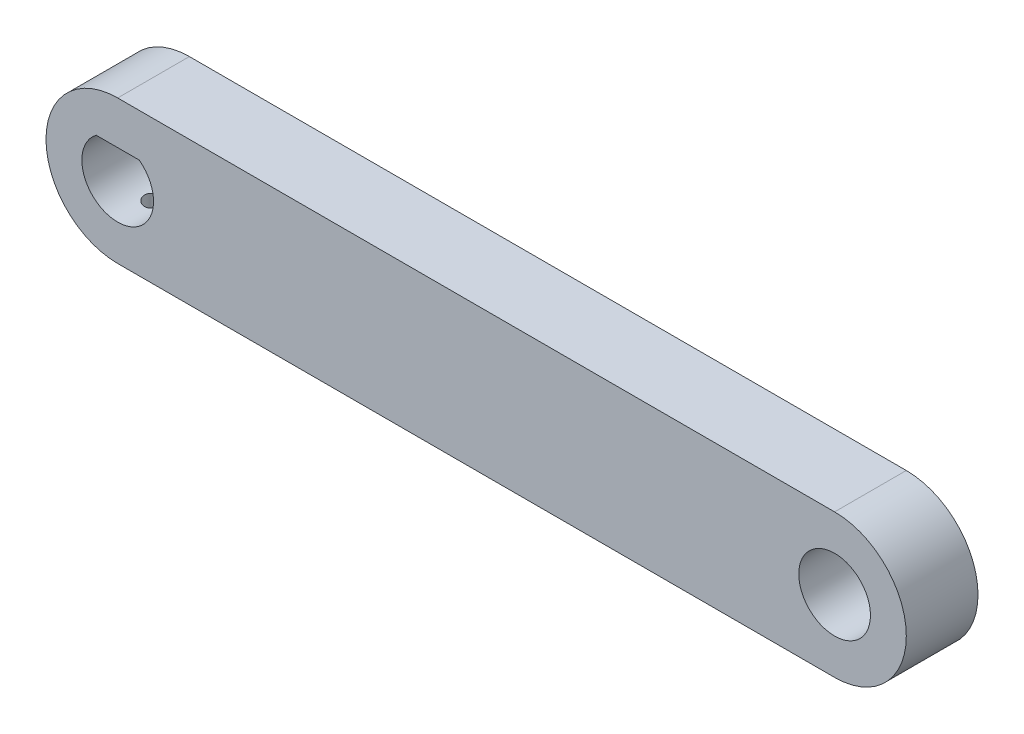
ISO-10303-21;
HEADER;
FILE_DESCRIPTION(('STEP AP214'),'2;1');
FILE_NAME('part.step','',(''),(''),'','','');
FILE_SCHEMA(('AUTOMOTIVE_DESIGN { 1 0 10303 214 1 1 1 1 }'));
ENDSEC;
DATA;
#1=APPLICATION_CONTEXT('core data for automotive mechanical design processes');
#2=APPLICATION_PROTOCOL_DEFINITION('international standard','automotive_design',2000,#1);
#3=PRODUCT_CONTEXT('',#1,'mechanical');
#4=PRODUCT('Part','Part','',(#3));
#5=PRODUCT_RELATED_PRODUCT_CATEGORY('part','',(#4));
#6=PRODUCT_DEFINITION_FORMATION('','',#4);
#7=PRODUCT_DEFINITION_CONTEXT('part definition',#1,'design');
#8=PRODUCT_DEFINITION('design','',#6,#7);
#9=PRODUCT_DEFINITION_SHAPE('','',#8);
#10=(LENGTH_UNIT() NAMED_UNIT(*) SI_UNIT(.MILLI.,.METRE.));
#11=(NAMED_UNIT(*) PLANE_ANGLE_UNIT() SI_UNIT($,.RADIAN.));
#12=(NAMED_UNIT(*) SI_UNIT($,.STERADIAN.) SOLID_ANGLE_UNIT());
#13=UNCERTAINTY_MEASURE_WITH_UNIT(LENGTH_MEASURE(1.E-05),#10,'distance_accuracy_value','');
#14=(GEOMETRIC_REPRESENTATION_CONTEXT(3) GLOBAL_UNCERTAINTY_ASSIGNED_CONTEXT((#13)) GLOBAL_UNIT_ASSIGNED_CONTEXT((#10,
#11,#12)) REPRESENTATION_CONTEXT('',''));
#15=CARTESIAN_POINT('',(0.,0.,0.));
#16=DIRECTION('',(0.,0.,1.));
#17=DIRECTION('',(1.,0.,0.));
#18=AXIS2_PLACEMENT_3D('',#15,#16,#17);
#19=CARTESIAN_POINT('',(50.,0.,10.));
#20=DIRECTION('',(0.,0.,-1.));
#21=DIRECTION('',(-1.,0.,0.));
#22=AXIS2_PLACEMENT_3D('',#19,#20,#21);
#23=PLANE('',#22);
#24=CARTESIAN_POINT('',(50.,0.,10.));
#25=DIRECTION('',(0.,0.,1.));
#26=DIRECTION('',(1.,0.,0.));
#27=AXIS2_PLACEMENT_3D('',#24,#25,#26);
#28=CIRCLE('',#27,5.);
#29=CARTESIAN_POINT('',(55.,0.,10.));
#30=VERTEX_POINT('',#29);
#31=EDGE_CURVE('E130',#30,#30,#28,.T.);
#32=ORIENTED_EDGE('',*,*,#31,.F.);
#33=EDGE_LOOP('',(#32));
#34=FACE_BOUND('',#33,.T.);
#35=CARTESIAN_POINT('',(50.,0.,10.));
#36=DIRECTION('',(0.,0.,1.));
#37=DIRECTION('',(-1.,0.,0.));
#38=AXIS2_PLACEMENT_3D('',#35,#36,#37);
#39=CIRCLE('',#38,10.);
#40=CARTESIAN_POINT('',(50.,-10.,10.));
#41=VERTEX_POINT('',#40);
#42=CARTESIAN_POINT('',(50.,10.,10.));
#43=VERTEX_POINT('',#42);
#44=EDGE_CURVE('E122',#41,#43,#39,.T.);
#45=ORIENTED_EDGE('',*,*,#44,.T.);
#46=DIRECTION('',(-1.,0.,0.));
#47=VECTOR('',#46,1.);
#48=CARTESIAN_POINT('',(-50.,10.,10.));
#49=LINE('',#48,#47);
#50=CARTESIAN_POINT('',(-50.,10.,10.));
#51=VERTEX_POINT('',#50);
#52=EDGE_CURVE('E134',#43,#51,#49,.T.);
#53=ORIENTED_EDGE('',*,*,#52,.T.);
#54=CARTESIAN_POINT('',(-50.,0.,10.));
#55=DIRECTION('',(0.,0.,1.));
#56=DIRECTION('',(1.,0.,0.));
#57=AXIS2_PLACEMENT_3D('',#54,#55,#56);
#58=CIRCLE('',#57,10.);
#59=CARTESIAN_POINT('',(-50.,-10.,10.));
#60=VERTEX_POINT('',#59);
#61=EDGE_CURVE('E132',#51,#60,#58,.T.);
#62=ORIENTED_EDGE('',*,*,#61,.T.);
#63=DIRECTION('',(1.,0.,0.));
#64=VECTOR('',#63,1.);
#65=CARTESIAN_POINT('',(-50.,-10.,10.));
#66=LINE('',#65,#64);
#67=EDGE_CURVE('E112',#60,#41,#66,.T.);
#68=ORIENTED_EDGE('',*,*,#67,.T.);
#69=EDGE_LOOP('',(#45,#53,#62,#68));
#70=FACE_BOUND('',#69,.T.);
#71=CARTESIAN_POINT('',(-50.,0.,10.));
#72=DIRECTION('',(0.,0.,1.));
#73=DIRECTION('',(1.,0.,0.));
#74=AXIS2_PLACEMENT_3D('',#71,#72,#73);
#75=CIRCLE('',#74,5.);
#76=CARTESIAN_POINT('',(-53.,4.,10.));
#77=VERTEX_POINT('',#76);
#78=CARTESIAN_POINT('',(-47.,4.,10.));
#79=VERTEX_POINT('',#78);
#80=EDGE_CURVE('E151',#77,#79,#75,.T.);
#81=ORIENTED_EDGE('',*,*,#80,.F.);
#82=DIRECTION('',(-1.,0.,0.));
#83=VECTOR('',#82,1.);
#84=CARTESIAN_POINT('',(-53.,4.,10.));
#85=LINE('',#84,#83);
#86=EDGE_CURVE('E147',#79,#77,#85,.T.);
#87=ORIENTED_EDGE('',*,*,#86,.F.);
#88=EDGE_LOOP('',(#81,#87));
#89=FACE_BOUND('',#88,.T.);
#90=ADVANCED_FACE('F33',(#34,#70,#89),#23,.F.);
#91=CARTESIAN_POINT('',(50.,0.,0.));
#92=DIRECTION('',(0.,0.,-1.));
#93=DIRECTION('',(-1.,0.,0.));
#94=AXIS2_PLACEMENT_3D('',#91,#92,#93);
#95=PLANE('',#94);
#96=CARTESIAN_POINT('',(50.,0.,0.));
#97=DIRECTION('',(0.,0.,1.));
#98=DIRECTION('',(-1.,0.,0.));
#99=AXIS2_PLACEMENT_3D('',#96,#97,#98);
#100=CIRCLE('',#99,10.);
#101=CARTESIAN_POINT('',(50.,-10.,0.));
#102=VERTEX_POINT('',#101);
#103=CARTESIAN_POINT('',(50.,10.,0.));
#104=VERTEX_POINT('',#103);
#105=EDGE_CURVE('E127',#102,#104,#100,.T.);
#106=ORIENTED_EDGE('',*,*,#105,.F.);
#107=DIRECTION('',(1.,0.,0.));
#108=VECTOR('',#107,1.);
#109=CARTESIAN_POINT('',(-50.,-10.,0.));
#110=LINE('',#109,#108);
#111=CARTESIAN_POINT('',(-50.,-10.,0.));
#112=VERTEX_POINT('',#111);
#113=EDGE_CURVE('E120',#112,#102,#110,.T.);
#114=ORIENTED_EDGE('',*,*,#113,.F.);
#115=CARTESIAN_POINT('',(-50.,0.,0.));
#116=DIRECTION('',(0.,0.,1.));
#117=DIRECTION('',(1.,0.,0.));
#118=AXIS2_PLACEMENT_3D('',#115,#116,#117);
#119=CIRCLE('',#118,10.);
#120=CARTESIAN_POINT('',(-50.,10.,0.));
#121=VERTEX_POINT('',#120);
#122=EDGE_CURVE('E123',#121,#112,#119,.T.);
#123=ORIENTED_EDGE('',*,*,#122,.F.);
#124=DIRECTION('',(-1.,0.,0.));
#125=VECTOR('',#124,1.);
#126=CARTESIAN_POINT('',(-50.,10.,0.));
#127=LINE('',#126,#125);
#128=EDGE_CURVE('E125',#104,#121,#127,.T.);
#129=ORIENTED_EDGE('',*,*,#128,.F.);
#130=EDGE_LOOP('',(#106,#114,#123,#129));
#131=FACE_BOUND('',#130,.T.);
#132=CARTESIAN_POINT('',(50.,0.,0.));
#133=DIRECTION('',(0.,0.,1.));
#134=DIRECTION('',(1.,0.,0.));
#135=AXIS2_PLACEMENT_3D('',#132,#133,#134);
#136=CIRCLE('',#135,5.);
#137=CARTESIAN_POINT('',(55.,0.,0.));
#138=VERTEX_POINT('',#137);
#139=EDGE_CURVE('E138',#138,#138,#136,.T.);
#140=ORIENTED_EDGE('',*,*,#139,.T.);
#141=EDGE_LOOP('',(#140));
#142=FACE_BOUND('',#141,.T.);
#143=DIRECTION('',(-1.,0.,0.));
#144=VECTOR('',#143,1.);
#145=CARTESIAN_POINT('',(-53.,4.,0.));
#146=LINE('',#145,#144);
#147=CARTESIAN_POINT('',(-47.,4.,0.));
#148=VERTEX_POINT('',#147);
#149=CARTESIAN_POINT('',(-53.,4.,0.));
#150=VERTEX_POINT('',#149);
#151=EDGE_CURVE('E148',#148,#150,#146,.T.);
#152=ORIENTED_EDGE('',*,*,#151,.T.);
#153=CARTESIAN_POINT('',(-50.,0.,0.));
#154=DIRECTION('',(0.,0.,1.));
#155=DIRECTION('',(1.,0.,0.));
#156=AXIS2_PLACEMENT_3D('',#153,#154,#155);
#157=CIRCLE('',#156,5.);
#158=EDGE_CURVE('E108',#150,#148,#157,.T.);
#159=ORIENTED_EDGE('',*,*,#158,.T.);
#160=EDGE_LOOP('',(#152,#159));
#161=FACE_BOUND('',#160,.T.);
#162=ADVANCED_FACE('F179',(#131,#142,#161),#95,.T.);
#163=CARTESIAN_POINT('',(50.,0.,10.));
#164=DIRECTION('',(0.,0.,-1.));
#165=DIRECTION('',(-1.,0.,0.));
#166=AXIS2_PLACEMENT_3D('',#163,#164,#165);
#167=CYLINDRICAL_SURFACE('',#166,10.);
#168=ORIENTED_EDGE('',*,*,#105,.T.);
#169=DIRECTION('',(0.,0.,-1.));
#170=VECTOR('',#169,1.);
#171=CARTESIAN_POINT('',(50.,10.,10.));
#172=LINE('',#171,#170);
#173=EDGE_CURVE('E11',#43,#104,#172,.T.);
#174=ORIENTED_EDGE('',*,*,#173,.F.);
#175=ORIENTED_EDGE('',*,*,#44,.F.);
#176=DIRECTION('',(0.,0.,-1.));
#177=VECTOR('',#176,1.);
#178=CARTESIAN_POINT('',(50.,-10.,10.));
#179=LINE('',#178,#177);
#180=EDGE_CURVE('E116',#41,#102,#179,.T.);
#181=ORIENTED_EDGE('',*,*,#180,.T.);
#182=EDGE_LOOP('',(#168,#174,#175,#181));
#183=FACE_BOUND('',#182,.T.);
#184=ADVANCED_FACE('F35',(#183),#167,.T.);
#185=CARTESIAN_POINT('',(-50.,10.,10.));
#186=DIRECTION('',(0.,-1.,0.));
#187=DIRECTION('',(0.,0.,-1.));
#188=AXIS2_PLACEMENT_3D('',#185,#186,#187);
#189=PLANE('',#188);
#190=ORIENTED_EDGE('',*,*,#128,.T.);
#191=DIRECTION('',(0.,0.,-1.));
#192=VECTOR('',#191,1.);
#193=CARTESIAN_POINT('',(-50.,10.,10.));
#194=LINE('',#193,#192);
#195=EDGE_CURVE('E46',#51,#121,#194,.T.);
#196=ORIENTED_EDGE('',*,*,#195,.F.);
#197=ORIENTED_EDGE('',*,*,#52,.F.);
#198=ORIENTED_EDGE('',*,*,#173,.T.);
#199=EDGE_LOOP('',(#190,#196,#197,#198));
#200=FACE_BOUND('',#199,.T.);
#201=ADVANCED_FACE('F187',(#200),#189,.F.);
#202=CARTESIAN_POINT('',(-50.,0.,10.));
#203=DIRECTION('',(0.,0.,-1.));
#204=DIRECTION('',(-1.,0.,0.));
#205=AXIS2_PLACEMENT_3D('',#202,#203,#204);
#206=CYLINDRICAL_SURFACE('',#205,10.);
#207=DIRECTION('',(0.,0.,-1.));
#208=VECTOR('',#207,1.);
#209=CARTESIAN_POINT('',(-50.,-10.,10.));
#210=LINE('',#209,#208);
#211=CARTESIAN_POINT('',(-50.,-10.,3.75));
#212=VERTEX_POINT('',#211);
#213=EDGE_CURVE('E107',#212,#112,#210,.T.);
#214=ORIENTED_EDGE('',*,*,#213,.F.);
#215=CARTESIAN_POINT('',(-50.,-10.,3.75));
#216=CARTESIAN_POINT('',(-50.0350224303089,-10.0000010257072,3.75000007275596));
#217=CARTESIAN_POINT('',(-50.070027951116,-9.99981578224008,3.75147281210121));
#218=CARTESIAN_POINT('',(-50.1397858706033,-9.99908364149504,3.75734711411078));
#219=CARTESIAN_POINT('',(-50.1745382883709,-9.99853677178007,3.7617484535589));
#220=CARTESIAN_POINT('',(-50.2779631546587,-9.99637276286865,3.77929857508668));
#221=CARTESIAN_POINT('',(-50.3459386360616,-9.99423214223442,3.79679360712196));
#222=CARTESIAN_POINT('',(-50.4779570703992,-9.98879054889774,3.84286830901248));
#223=CARTESIAN_POINT('',(-50.5419987145779,-9.9854891924577,3.87145164496846));
#224=CARTESIAN_POINT('',(-50.6643811009187,-9.97809384677873,3.93887994605988));
#225=CARTESIAN_POINT('',(-50.722722300247,-9.97399992118116,3.97772408736892));
#226=CARTESIAN_POINT('',(-50.8323544687385,-9.96545183597717,4.06479376319411));
#227=CARTESIAN_POINT('',(-50.8836101263094,-9.96099603624693,4.11306358291034));
#228=CARTESIAN_POINT('',(-50.9773217643362,-9.95223907260072,4.21752559335189));
#229=CARTESIAN_POINT('',(-51.019776388504,-9.94793793260296,4.27371900290764));
#230=CARTESIAN_POINT('',(-51.0948062657025,-9.93996140974645,4.3926617665809));
#231=CARTESIAN_POINT('',(-51.1273480009107,-9.93628816793261,4.45543241933371));
#232=CARTESIAN_POINT('',(-51.1814128031938,-9.93000548633833,4.58559753444209));
#233=CARTESIAN_POINT('',(-51.2029369412445,-9.92739594316509,4.65299154665718));
#234=CARTESIAN_POINT('',(-51.2342493040182,-9.92355172150395,4.7901212644795));
#235=CARTESIAN_POINT('',(-51.24409812009,-9.92230994711778,4.85984293218617));
#236=CARTESIAN_POINT('',(-51.2519678206247,-9.92132013485285,4.99996142018386));
#237=CARTESIAN_POINT('',(-51.2499888940935,-9.92157207310476,5.07035822966826));
#238=CARTESIAN_POINT('',(-51.2343085986478,-9.92353477948583,5.20940260389039));
#239=CARTESIAN_POINT('',(-51.2206743119572,-9.92523719920774,5.27805786823219));
#240=CARTESIAN_POINT('',(-51.1821750510369,-9.92989601478217,5.41209786692299));
#241=CARTESIAN_POINT('',(-51.1573099103287,-9.93285242922303,5.47748255277518));
#242=CARTESIAN_POINT('',(-51.0969821605309,-9.93969565200488,5.60333533117188));
#243=CARTESIAN_POINT('',(-51.0614901967918,-9.94358503149479,5.66378920692038));
#244=CARTESIAN_POINT('',(-50.9809387493245,-9.95185374242074,5.7779056290516));
#245=CARTESIAN_POINT('',(-50.9358792321645,-9.95623307556881,5.83156815170238));
#246=CARTESIAN_POINT('',(-50.8371071202266,-9.96502490265528,5.9309640101088));
#247=CARTESIAN_POINT('',(-50.7833378693899,-9.96943741991863,5.97664105513599));
#248=CARTESIAN_POINT('',(-50.6688454595002,-9.97777199832716,6.05834385361847));
#249=CARTESIAN_POINT('',(-50.6081202467897,-9.98169391390991,6.09436674627331));
#250=CARTESIAN_POINT('',(-50.4813882328032,-9.98860831905769,6.15573798095924));
#251=CARTESIAN_POINT('',(-50.4153766207039,-9.99159994965887,6.18107646534996));
#252=CARTESIAN_POINT('',(-50.2800377252035,-9.99630636768367,6.2202562741537));
#253=CARTESIAN_POINT('',(-50.2107155962609,-9.99802307533887,6.23411489267255));
#254=CARTESIAN_POINT('',(-50.1174122453479,-9.99933843065654,6.2446975065853));
#255=CARTESIAN_POINT('',(-50.0939537284046,-9.99958635198375,6.24668688667698));
#256=CARTESIAN_POINT('',(-50.0470001193228,-9.99991694240981,6.24933635438594));
#257=CARTESIAN_POINT('',(-50.0235051549881,-9.9999998886439,6.2499986712988));
#258=CARTESIAN_POINT('',(-50.,-10.,6.25));
#259=B_SPLINE_CURVE_WITH_KNOTS('',3,(#215,#216,#217,#218,#219,#220,#221,#222,#223,#224,#225,
#226,#227,#228,#229,#230,#231,#232,#233,#234,#235,#236,#237,#238,#239,#240,#241,#242,#243,#244,
#245,#246,#247,#248,#249,#250,#251,#252,#253,#254,#255,#256,#257,#258),.UNSPECIFIED.,.F.,.F.,(4,
2,2,2,2,2,2,2,2,2,2,2,2,2,2,2,2,2,2,2,2,4),(0.,0.105002335264217,0.209996668227908,
0.419584276421345,0.629241239230481,0.838881374074515,1.04953126046246,1.26021358506995,
1.4716005653559,1.682966993669,1.89323162462972,2.10349289559813,2.3125520967703,
2.52161439699687,2.73125960655484,2.94090554868384,3.1519744416163,3.36310581129235,
3.57443155085659,3.78543835196968,3.85604268677622,3.92652831560037),.UNSPECIFIED.);
#260=CARTESIAN_POINT('',(-50.,-10.,6.25));
#261=VERTEX_POINT('',#260);
#262=EDGE_CURVE('E52',#212,#261,#259,.T.);
#263=ORIENTED_EDGE('',*,*,#262,.T.);
#264=EDGE_CURVE('E104',#60,#261,#210,.T.);
#265=ORIENTED_EDGE('',*,*,#264,.F.);
#266=ORIENTED_EDGE('',*,*,#61,.F.);
#267=ORIENTED_EDGE('',*,*,#195,.T.);
#268=ORIENTED_EDGE('',*,*,#122,.T.);
#269=EDGE_LOOP('',(#214,#263,#265,#266,#267,#268));
#270=FACE_BOUND('',#269,.T.);
#271=ADVANCED_FACE('F102',(#270),#206,.T.);
#272=CARTESIAN_POINT('',(-50.,-10.,10.));
#273=DIRECTION('',(0.,1.,0.));
#274=DIRECTION('',(0.,0.,1.));
#275=AXIS2_PLACEMENT_3D('',#272,#273,#274);
#276=PLANE('',#275);
#277=ORIENTED_EDGE('',*,*,#264,.T.);
#278=CARTESIAN_POINT('',(-50.,-10.,5.));
#279=DIRECTION('',(0.,-1.,0.));
#280=DIRECTION('',(0.,0.,-1.));
#281=AXIS2_PLACEMENT_3D('',#278,#279,#280);
#282=CIRCLE('',#281,1.25);
#283=EDGE_CURVE('E94',#212,#261,#282,.T.);
#284=ORIENTED_EDGE('',*,*,#283,.F.);
#285=ORIENTED_EDGE('',*,*,#213,.T.);
#286=ORIENTED_EDGE('',*,*,#113,.T.);
#287=ORIENTED_EDGE('',*,*,#180,.F.);
#288=ORIENTED_EDGE('',*,*,#67,.F.);
#289=EDGE_LOOP('',(#277,#284,#285,#286,#287,#288));
#290=FACE_BOUND('',#289,.T.);
#291=ADVANCED_FACE('F110',(#290),#276,.F.);
#292=CARTESIAN_POINT('',(50.,0.,10.));
#293=DIRECTION('',(0.,0.,-1.));
#294=DIRECTION('',(-1.,0.,0.));
#295=AXIS2_PLACEMENT_3D('',#292,#293,#294);
#296=CYLINDRICAL_SURFACE('',#295,5.);
#297=ORIENTED_EDGE('',*,*,#31,.T.);
#298=EDGE_LOOP('',(#297));
#299=FACE_BOUND('',#298,.T.);
#300=ORIENTED_EDGE('',*,*,#139,.F.);
#301=EDGE_LOOP('',(#300));
#302=FACE_BOUND('',#301,.T.);
#303=ADVANCED_FACE('F172',(#299,#302),#296,.F.);
#304=CARTESIAN_POINT('',(-50.,0.,10.));
#305=DIRECTION('',(0.,0.,-1.));
#306=DIRECTION('',(-1.,0.,0.));
#307=AXIS2_PLACEMENT_3D('',#304,#305,#306);
#308=CYLINDRICAL_SURFACE('',#307,5.);
#309=CARTESIAN_POINT('',(-50.,-5.,3.75));
#310=CARTESIAN_POINT('',(-50.0690634072248,-4.99999883223344,3.75000193811513));
#311=CARTESIAN_POINT('',(-50.138148464859,-4.99855481776523,3.75574295897815));
#312=CARTESIAN_POINT('',(-50.2743386031421,-4.99293428191577,3.7785209594225));
#313=CARTESIAN_POINT('',(-50.3414425390589,-4.98875621183307,3.79556434128154));
#314=CARTESIAN_POINT('',(-50.4716840601521,-4.97813021943366,3.84036604455174));
#315=CARTESIAN_POINT('',(-50.5348263028583,-4.97168502368405,3.8681114989294));
#316=CARTESIAN_POINT('',(-50.6555601099204,-4.9572111983966,3.93348449170403));
#317=CARTESIAN_POINT('',(-50.7131514869573,-4.94918251545042,3.97111236343245));
#318=CARTESIAN_POINT('',(-50.8223349394174,-4.93222844659834,4.05600065804518));
#319=CARTESIAN_POINT('',(-50.8737964083842,-4.92328922623777,4.10342631246598));
#320=CARTESIAN_POINT('',(-50.9681241060028,-4.90561350097941,4.20621017075743));
#321=CARTESIAN_POINT('',(-51.0109893641243,-4.89687701906957,4.26156926912208));
#322=CARTESIAN_POINT('',(-51.0875221189992,-4.88045646416425,4.37966268894786));
#323=CARTESIAN_POINT('',(-51.1210435132711,-4.87278995392171,4.44249435900867));
#324=CARTESIAN_POINT('',(-51.1769974237921,-4.85957912343519,4.57312367638196));
#325=CARTESIAN_POINT('',(-51.1994317128661,-4.8540344639399,4.64092052777147));
#326=CARTESIAN_POINT('',(-51.2321290306702,-4.84583730597959,4.7781195818354));
#327=CARTESIAN_POINT('',(-51.2426268902778,-4.84312909229521,4.84746241337484));
#328=CARTESIAN_POINT('',(-51.2518848125565,-4.8407446878145,4.98697380751165));
#329=CARTESIAN_POINT('',(-51.2506467848483,-4.84106800373869,5.05714223391551));
#330=CARTESIAN_POINT('',(-51.2366554371994,-4.84466004580515,5.1945131731204));
#331=CARTESIAN_POINT('',(-51.2241819501588,-4.84785719168232,5.26174635122092));
#332=CARTESIAN_POINT('',(-51.1885201557526,-4.85672258063736,5.39313420909275));
#333=CARTESIAN_POINT('',(-51.1653310850579,-4.8623909997558,5.45728866919082));
#334=CARTESIAN_POINT('',(-51.108657898281,-4.87562594920155,5.58144834687672));
#335=CARTESIAN_POINT('',(-51.0750722226941,-4.88321106224517,5.64140514315796));
#336=CARTESIAN_POINT('',(-50.9986302300125,-4.89941425705321,5.7549322581307));
#337=CARTESIAN_POINT('',(-50.955772290674,-4.90803251945612,5.80850145672272));
#338=CARTESIAN_POINT('',(-50.860552853901,-4.92563233783151,5.90933634641201));
#339=CARTESIAN_POINT('',(-50.8079552151382,-4.93461724564976,5.9563787417178));
#340=CARTESIAN_POINT('',(-50.6955099312531,-4.95171637982321,6.04101770205326));
#341=CARTESIAN_POINT('',(-50.6356620647566,-4.95983057957846,6.07861397855297));
#342=CARTESIAN_POINT('',(-50.5100965739012,-4.97431443411819,6.14337548852033));
#343=CARTESIAN_POINT('',(-50.4443594943405,-4.98067800106437,6.17050445021203));
#344=CARTESIAN_POINT('',(-50.3090633401191,-4.99089930826182,6.21326442142465));
#345=CARTESIAN_POINT('',(-50.2395049992921,-4.99475752782734,6.22889763034845));
#346=CARTESIAN_POINT('',(-50.100449975325,-4.99946249392812,6.24788130463237));
#347=CARTESIAN_POINT('',(-50.0309972666568,-5.00038377923565,6.25153585506275));
#348=CARTESIAN_POINT('',(-49.8924726043321,-4.99932337345376,6.2472924982871));
#349=CARTESIAN_POINT('',(-49.8234006169628,-4.99734194368205,6.23939563100073));
#350=CARTESIAN_POINT('',(-49.6886547760196,-4.99074650939464,6.21252424300719));
#351=CARTESIAN_POINT('',(-49.6229457341927,-4.98617195154843,6.19371561376918));
#352=CARTESIAN_POINT('',(-49.4956189229562,-4.97490588861778,6.14574409664297));
#353=CARTESIAN_POINT('',(-49.4340015674728,-4.9682141697491,6.11658016307236));
#354=CARTESIAN_POINT('',(-49.3153973879751,-4.95327756605259,6.04813655927107));
#355=CARTESIAN_POINT('',(-49.2585121318035,-4.94500722805777,6.00868657300271));
#356=CARTESIAN_POINT('',(-49.1520611552973,-4.92787090989516,5.92100840933587));
#357=CARTESIAN_POINT('',(-49.1024967008558,-4.91900482709754,5.87277871698591));
#358=CARTESIAN_POINT('',(-49.0108411932727,-4.90140797467309,5.76749836596295));
#359=CARTESIAN_POINT('',(-48.9689634436483,-4.89268586822734,5.71026024749798));
#360=CARTESIAN_POINT('',(-48.8954077008227,-4.87660731981032,5.58938947127857));
#361=CARTESIAN_POINT('',(-48.8637292548684,-4.86925081722522,5.52575709753354));
#362=CARTESIAN_POINT('',(-48.8117071494922,-4.85681745612221,5.39424523132243));
#363=CARTESIAN_POINT('',(-48.7912963361216,-4.85172712743255,5.32639364304666));
#364=CARTESIAN_POINT('',(-48.7622119500385,-4.84438953408486,5.18807530175907));
#365=CARTESIAN_POINT('',(-48.7535358104344,-4.84214164766613,5.11760912413959));
#366=CARTESIAN_POINT('',(-48.7483011747217,-4.84079084336631,4.97823248012066));
#367=CARTESIAN_POINT('',(-48.7514017518499,-4.8415994394022,4.90933547072939));
#368=CARTESIAN_POINT('',(-48.7688522680726,-4.84606590839869,4.77308009277668));
#369=CARTESIAN_POINT('',(-48.7832019810944,-4.84972372409881,4.70572169332196));
#370=CARTESIAN_POINT('',(-48.8225572337977,-4.85942717235602,4.57482628411216));
#371=CARTESIAN_POINT('',(-48.847498829433,-4.86545846030258,4.51126891229982));
#372=CARTESIAN_POINT('',(-48.9072792386624,-4.87923129770691,4.38919551440525));
#373=CARTESIAN_POINT('',(-48.9421194249715,-4.88697308433978,4.3306801890109));
#374=CARTESIAN_POINT('',(-49.0217768761357,-4.90354695219593,4.21870447583165));
#375=CARTESIAN_POINT('',(-49.0668306975731,-4.91240220693131,4.1654157721467));
#376=CARTESIAN_POINT('',(-49.1651755240085,-4.93006689371905,4.06704412933716));
#377=CARTESIAN_POINT('',(-49.2184684822824,-4.93887631439216,4.02196314157252));
#378=CARTESIAN_POINT('',(-49.3329436777478,-4.95564713039719,3.94049057619616));
#379=CARTESIAN_POINT('',(-49.3942513147363,-4.9635902780489,3.90427115527368));
#380=CARTESIAN_POINT('',(-49.5222782837413,-4.97754104145932,3.84271044754956));
#381=CARTESIAN_POINT('',(-49.588993697136,-4.98355004333151,3.81736136612622));
#382=CARTESIAN_POINT('',(-49.7129914556304,-4.99206716304618,3.78202347472528));
#383=CARTESIAN_POINT('',(-49.7696831909099,-4.99502154210576,3.7700406307888));
#384=CARTESIAN_POINT('',(-49.8842449403864,-4.9989883769329,3.75402838031504));
#385=CARTESIAN_POINT('',(-49.9421148656312,-5.00000097875745,3.74999837557891));
#386=CARTESIAN_POINT('',(-50.,-5.,3.75));
#387=B_SPLINE_CURVE_WITH_KNOTS('',3,(#309,#310,#311,#312,#313,#314,#315,#316,#317,#318,#319,
#320,#321,#322,#323,#324,#325,#326,#327,#328,#329,#330,#331,#332,#333,#334,#335,#336,#337,#338,
#339,#340,#341,#342,#343,#344,#345,#346,#347,#348,#349,#350,#351,#352,#353,#354,#355,#356,#357,
#358,#359,#360,#361,#362,#363,#364,#365,#366,#367,#368,#369,#370,#371,#372,#373,#374,#375,#376,
#377,#378,#379,#380,#381,#382,#383,#384,#385,#386),.UNSPECIFIED.,.T.,.F.,(4,2,2,2,2,2,2,2,2,2,2,
2,2,2,2,2,2,2,2,2,2,2,2,2,2,2,2,2,2,2,2,2,2,2,2,2,2,2,4),(0.,0.206978093726575,
0.414073531469918,0.6209207519051,0.827774950141119,1.03845362864283,1.24915607983385,
1.46298872954839,1.67678717641141,1.88630245916193,2.09578365093915,2.30018747505849,
2.504605862217,2.71108773228234,2.91760575696804,3.13001250807517,3.34242574631874,
3.55556857507598,3.76867061407204,3.97631924124398,4.18394917593953,4.38850228761699,
4.5930760610191,4.80127989637794,5.00951969173351,5.22287091003732,5.43621265624592,
5.64826878845032,5.86027852710342,6.06619816998846,6.27211367463364,6.47680333799542,
6.68152140114087,6.89157980341594,7.10168808142017,7.31560154582992,7.52936136517793,
7.70285202451794,7.87632963369202),.UNSPECIFIED.);
#388=CARTESIAN_POINT('',(-50.,-5.,3.75));
#389=VERTEX_POINT('',#388);
#390=EDGE_CURVE('E37',#389,#389,#387,.T.);
#391=ORIENTED_EDGE('',*,*,#390,.F.);
#392=EDGE_LOOP('',(#391));
#393=FACE_BOUND('',#392,.T.);
#394=ORIENTED_EDGE('',*,*,#158,.F.);
#395=DIRECTION('',(0.,0.,-1.));
#396=VECTOR('',#395,1.);
#397=CARTESIAN_POINT('',(-53.,4.,10.));
#398=LINE('',#397,#396);
#399=EDGE_CURVE('E144',#77,#150,#398,.T.);
#400=ORIENTED_EDGE('',*,*,#399,.F.);
#401=ORIENTED_EDGE('',*,*,#80,.T.);
#402=DIRECTION('',(0.,0.,-1.));
#403=VECTOR('',#402,1.);
#404=CARTESIAN_POINT('',(-47.,4.,10.));
#405=LINE('',#404,#403);
#406=EDGE_CURVE('E60',#79,#148,#405,.T.);
#407=ORIENTED_EDGE('',*,*,#406,.T.);
#408=EDGE_LOOP('',(#394,#400,#401,#407));
#409=FACE_BOUND('',#408,.T.);
#410=ADVANCED_FACE('F168',(#393,#409),#308,.F.);
#411=CARTESIAN_POINT('',(-53.,4.,10.));
#412=DIRECTION('',(0.,-1.,0.));
#413=DIRECTION('',(0.,0.,-1.));
#414=AXIS2_PLACEMENT_3D('',#411,#412,#413);
#415=PLANE('',#414);
#416=ORIENTED_EDGE('',*,*,#151,.F.);
#417=ORIENTED_EDGE('',*,*,#406,.F.);
#418=ORIENTED_EDGE('',*,*,#86,.T.);
#419=ORIENTED_EDGE('',*,*,#399,.T.);
#420=EDGE_LOOP('',(#416,#417,#418,#419));
#421=FACE_BOUND('',#420,.T.);
#422=ADVANCED_FACE('F164',(#421),#415,.T.);
#423=CARTESIAN_POINT('',(-50.,0.,5.));
#424=DIRECTION('',(0.,-1.,0.));
#425=DIRECTION('',(0.,0.,-1.));
#426=AXIS2_PLACEMENT_3D('',#423,#424,#425);
#427=CYLINDRICAL_SURFACE('',#426,1.25);
#428=ORIENTED_EDGE('',*,*,#390,.T.);
#429=EDGE_LOOP('',(#428));
#430=FACE_BOUND('',#429,.T.);
#431=ORIENTED_EDGE('',*,*,#283,.T.);
#432=ORIENTED_EDGE('',*,*,#262,.F.);
#433=EDGE_LOOP('',(#431,#432));
#434=FACE_BOUND('',#433,.T.);
#435=ADVANCED_FACE('F95',(#430,#434),#427,.F.);
#436=CLOSED_SHELL('',(#90,#162,#184,#201,#271,#291,#303,#410,#422,#435));
#437=MANIFOLD_SOLID_BREP('B2',#436);
#438=ADVANCED_BREP_SHAPE_REPRESENTATION('',(#18,#437),#14);
#439=SHAPE_DEFINITION_REPRESENTATION(#9,#438);
ENDSEC;
END-ISO-10303-21;
